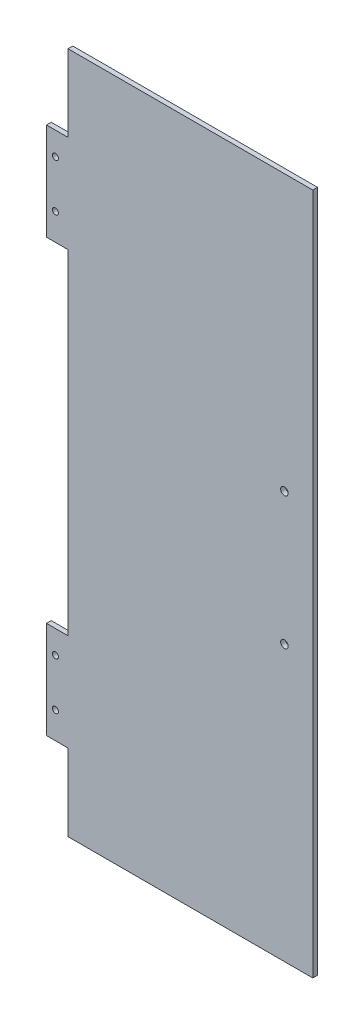
ISO-10303-21;
HEADER;
FILE_DESCRIPTION(('STEP AP214'),'2;1');
FILE_NAME('part.step','',(''),(''),'','','');
FILE_SCHEMA(('AUTOMOTIVE_DESIGN { 1 0 10303 214 1 1 1 1 }'));
ENDSEC;
DATA;
#1=APPLICATION_CONTEXT('core data for automotive mechanical design processes');
#2=APPLICATION_PROTOCOL_DEFINITION('international standard','automotive_design',2000,#1);
#3=PRODUCT_CONTEXT('',#1,'mechanical');
#4=PRODUCT('Part','Part','',(#3));
#5=PRODUCT_RELATED_PRODUCT_CATEGORY('part','',(#4));
#6=PRODUCT_DEFINITION_FORMATION('','',#4);
#7=PRODUCT_DEFINITION_CONTEXT('part definition',#1,'design');
#8=PRODUCT_DEFINITION('design','',#6,#7);
#9=PRODUCT_DEFINITION_SHAPE('','',#8);
#10=(LENGTH_UNIT() NAMED_UNIT(*) SI_UNIT(.MILLI.,.METRE.));
#11=(NAMED_UNIT(*) PLANE_ANGLE_UNIT() SI_UNIT($,.RADIAN.));
#12=(NAMED_UNIT(*) SI_UNIT($,.STERADIAN.) SOLID_ANGLE_UNIT());
#13=UNCERTAINTY_MEASURE_WITH_UNIT(LENGTH_MEASURE(1.E-05),#10,'distance_accuracy_value','');
#14=(GEOMETRIC_REPRESENTATION_CONTEXT(3) GLOBAL_UNCERTAINTY_ASSIGNED_CONTEXT((#13)) GLOBAL_UNIT_ASSIGNED_CONTEXT((#10,
#11,#12)) REPRESENTATION_CONTEXT('',''));
#15=CARTESIAN_POINT('',(0.,0.,0.));
#16=DIRECTION('',(0.,0.,1.));
#17=DIRECTION('',(1.,0.,0.));
#18=AXIS2_PLACEMENT_3D('',#15,#16,#17);
#19=CARTESIAN_POINT('',(0.,0.,3.175));
#20=DIRECTION('',(0.,-1.,0.));
#21=DIRECTION('',(0.,0.,-1.));
#22=AXIS2_PLACEMENT_3D('',#19,#20,#21);
#23=PLANE('',#22);
#24=DIRECTION('',(-1.,0.,0.));
#25=VECTOR('',#24,1.);
#26=CARTESIAN_POINT('',(0.,0.,0.));
#27=LINE('',#26,#25);
#28=CARTESIAN_POINT('',(0.,0.,0.));
#29=VERTEX_POINT('',#28);
#30=CARTESIAN_POINT('',(-164.338,0.,0.));
#31=VERTEX_POINT('',#30);
#32=EDGE_CURVE('E188',#29,#31,#27,.T.);
#33=ORIENTED_EDGE('',*,*,#32,.F.);
#34=DIRECTION('',(0.,0.,-1.));
#35=VECTOR('',#34,1.);
#36=CARTESIAN_POINT('',(0.,0.,3.175));
#37=LINE('',#36,#35);
#38=CARTESIAN_POINT('',(0.,0.,3.175));
#39=VERTEX_POINT('',#38);
#40=EDGE_CURVE('E148',#39,#29,#37,.T.);
#41=ORIENTED_EDGE('',*,*,#40,.F.);
#42=DIRECTION('',(-1.,0.,0.));
#43=VECTOR('',#42,1.);
#44=CARTESIAN_POINT('',(0.,0.,3.175));
#45=LINE('',#44,#43);
#46=CARTESIAN_POINT('',(-164.338,0.,3.175));
#47=VERTEX_POINT('',#46);
#48=EDGE_CURVE('E208',#39,#47,#45,.T.);
#49=ORIENTED_EDGE('',*,*,#48,.T.);
#50=DIRECTION('',(0.,0.,-1.));
#51=VECTOR('',#50,1.);
#52=CARTESIAN_POINT('',(-164.338,0.,3.175));
#53=LINE('',#52,#51);
#54=EDGE_CURVE('E145',#47,#31,#53,.T.);
#55=ORIENTED_EDGE('',*,*,#54,.T.);
#56=EDGE_LOOP('',(#33,#41,#49,#55));
#57=FACE_BOUND('',#56,.T.);
#58=ADVANCED_FACE('F75',(#57),#23,.T.);
#59=CARTESIAN_POINT('',(0.,0.,3.175));
#60=DIRECTION('',(-1.,0.,0.));
#61=DIRECTION('',(0.,0.,1.));
#62=AXIS2_PLACEMENT_3D('',#59,#60,#61);
#63=PLANE('',#62);
#64=DIRECTION('',(0.,1.,0.));
#65=VECTOR('',#64,1.);
#66=CARTESIAN_POINT('',(0.,0.,0.));
#67=LINE('',#66,#65);
#68=CARTESIAN_POINT('',(0.,458.216,0.));
#69=VERTEX_POINT('',#68);
#70=EDGE_CURVE('E185',#29,#69,#67,.T.);
#71=ORIENTED_EDGE('',*,*,#70,.T.);
#72=DIRECTION('',(0.,0.,-1.));
#73=VECTOR('',#72,1.);
#74=CARTESIAN_POINT('',(0.,458.216,3.175));
#75=LINE('',#74,#73);
#76=CARTESIAN_POINT('',(0.,458.216,3.175));
#77=VERTEX_POINT('',#76);
#78=EDGE_CURVE('E151',#77,#69,#75,.T.);
#79=ORIENTED_EDGE('',*,*,#78,.F.);
#80=DIRECTION('',(0.,1.,0.));
#81=VECTOR('',#80,1.);
#82=CARTESIAN_POINT('',(0.,0.,3.175));
#83=LINE('',#82,#81);
#84=EDGE_CURVE('E205',#39,#77,#83,.T.);
#85=ORIENTED_EDGE('',*,*,#84,.F.);
#86=ORIENTED_EDGE('',*,*,#40,.T.);
#87=EDGE_LOOP('',(#71,#79,#85,#86));
#88=FACE_BOUND('',#87,.T.);
#89=ADVANCED_FACE('F293',(#88),#63,.F.);
#90=CARTESIAN_POINT('',(0.,458.216,3.175));
#91=DIRECTION('',(0.,-1.,0.));
#92=DIRECTION('',(0.,0.,-1.));
#93=AXIS2_PLACEMENT_3D('',#90,#91,#92);
#94=PLANE('',#93);
#95=DIRECTION('',(-1.,0.,0.));
#96=VECTOR('',#95,1.);
#97=CARTESIAN_POINT('',(0.,458.216,0.));
#98=LINE('',#97,#96);
#99=CARTESIAN_POINT('',(-164.338,458.216,0.));
#100=VERTEX_POINT('',#99);
#101=EDGE_CURVE('E181',#69,#100,#98,.T.);
#102=ORIENTED_EDGE('',*,*,#101,.T.);
#103=DIRECTION('',(0.,0.,-1.));
#104=VECTOR('',#103,1.);
#105=CARTESIAN_POINT('',(-164.338,458.216,3.175));
#106=LINE('',#105,#104);
#107=CARTESIAN_POINT('',(-164.338,458.216,3.175));
#108=VERTEX_POINT('',#107);
#109=EDGE_CURVE('E154',#108,#100,#106,.T.);
#110=ORIENTED_EDGE('',*,*,#109,.F.);
#111=DIRECTION('',(-1.,0.,0.));
#112=VECTOR('',#111,1.);
#113=CARTESIAN_POINT('',(0.,458.216,3.175));
#114=LINE('',#113,#112);
#115=EDGE_CURVE('E201',#77,#108,#114,.T.);
#116=ORIENTED_EDGE('',*,*,#115,.F.);
#117=ORIENTED_EDGE('',*,*,#78,.T.);
#118=EDGE_LOOP('',(#102,#110,#116,#117));
#119=FACE_BOUND('',#118,.T.);
#120=ADVANCED_FACE('F336',(#119),#94,.F.);
#121=CARTESIAN_POINT('',(-164.338,0.,3.175));
#122=DIRECTION('',(-1.,0.,0.));
#123=DIRECTION('',(0.,0.,1.));
#124=AXIS2_PLACEMENT_3D('',#121,#122,#123);
#125=PLANE('',#124);
#126=DIRECTION('',(0.,1.,0.));
#127=VECTOR('',#126,1.);
#128=CARTESIAN_POINT('',(-164.338,0.,0.));
#129=LINE('',#128,#127);
#130=CARTESIAN_POINT('',(-164.338,406.654,0.));
#131=VERTEX_POINT('',#130);
#132=EDGE_CURVE('E184',#131,#100,#129,.T.);
#133=ORIENTED_EDGE('',*,*,#132,.F.);
#134=DIRECTION('',(0.,0.,1.));
#135=VECTOR('',#134,1.);
#136=CARTESIAN_POINT('',(-164.338,406.654,3.175));
#137=LINE('',#136,#135);
#138=CARTESIAN_POINT('',(-164.338,406.654,3.175));
#139=VERTEX_POINT('',#138);
#140=EDGE_CURVE('E85',#131,#139,#137,.T.);
#141=ORIENTED_EDGE('',*,*,#140,.T.);
#142=DIRECTION('',(0.,1.,0.));
#143=VECTOR('',#142,1.);
#144=CARTESIAN_POINT('',(-164.338,0.,3.175));
#145=LINE('',#144,#143);
#146=EDGE_CURVE('E204',#139,#108,#145,.T.);
#147=ORIENTED_EDGE('',*,*,#146,.T.);
#148=ORIENTED_EDGE('',*,*,#109,.T.);
#149=EDGE_LOOP('',(#133,#141,#147,#148));
#150=FACE_BOUND('',#149,.T.);
#151=ADVANCED_FACE('F334',(#150),#125,.T.);
#152=DIRECTION('',(0.,0.,1.));
#153=VECTOR('',#152,1.);
#154=CARTESIAN_POINT('',(-164.338,341.376,3.175));
#155=LINE('',#154,#153);
#156=CARTESIAN_POINT('',(-164.338,341.376,0.));
#157=VERTEX_POINT('',#156);
#158=CARTESIAN_POINT('',(-164.338,341.376,3.175));
#159=VERTEX_POINT('',#158);
#160=EDGE_CURVE('E12',#157,#159,#155,.T.);
#161=ORIENTED_EDGE('',*,*,#160,.F.);
#162=CARTESIAN_POINT('',(-164.338,116.84,0.));
#163=VERTEX_POINT('',#162);
#164=EDGE_CURVE('E180',#163,#157,#129,.T.);
#165=ORIENTED_EDGE('',*,*,#164,.F.);
#166=DIRECTION('',(0.,0.,-1.));
#167=VECTOR('',#166,1.);
#168=CARTESIAN_POINT('',(-164.338,116.84,3.175));
#169=LINE('',#168,#167);
#170=CARTESIAN_POINT('',(-164.338,116.84,3.175));
#171=VERTEX_POINT('',#170);
#172=EDGE_CURVE('E157',#171,#163,#169,.T.);
#173=ORIENTED_EDGE('',*,*,#172,.F.);
#174=EDGE_CURVE('E200',#171,#159,#145,.T.);
#175=ORIENTED_EDGE('',*,*,#174,.T.);
#176=EDGE_LOOP('',(#161,#165,#173,#175));
#177=FACE_BOUND('',#176,.T.);
#178=ADVANCED_FACE('F328',(#177),#125,.T.);
#179=CARTESIAN_POINT('',(1.11996182308678E-13,116.84,3.175));
#180=DIRECTION('',(0.,-1.,0.));
#181=DIRECTION('',(1.,0.,0.));
#182=AXIS2_PLACEMENT_3D('',#179,#180,#181);
#183=PLANE('',#182);
#184=DIRECTION('',(-1.,0.,0.));
#185=VECTOR('',#184,1.);
#186=CARTESIAN_POINT('',(1.11996182308678E-13,116.84,0.));
#187=LINE('',#186,#185);
#188=CARTESIAN_POINT('',(-178.816,116.84,0.));
#189=VERTEX_POINT('',#188);
#190=EDGE_CURVE('E177',#163,#189,#187,.T.);
#191=ORIENTED_EDGE('',*,*,#190,.T.);
#192=DIRECTION('',(0.,0.,-1.));
#193=VECTOR('',#192,1.);
#194=CARTESIAN_POINT('',(-178.816,116.84,3.175));
#195=LINE('',#194,#193);
#196=CARTESIAN_POINT('',(-178.816,116.84,3.175));
#197=VERTEX_POINT('',#196);
#198=EDGE_CURVE('E160',#197,#189,#195,.T.);
#199=ORIENTED_EDGE('',*,*,#198,.F.);
#200=DIRECTION('',(-1.,0.,0.));
#201=VECTOR('',#200,1.);
#202=CARTESIAN_POINT('',(1.11996182308678E-13,116.84,3.175));
#203=LINE('',#202,#201);
#204=EDGE_CURVE('E197',#171,#197,#203,.T.);
#205=ORIENTED_EDGE('',*,*,#204,.F.);
#206=ORIENTED_EDGE('',*,*,#172,.T.);
#207=EDGE_LOOP('',(#191,#199,#205,#206));
#208=FACE_BOUND('',#207,.T.);
#209=ADVANCED_FACE('F381',(#208),#183,.F.);
#210=CARTESIAN_POINT('',(-178.816,0.,3.175));
#211=DIRECTION('',(1.,0.,0.));
#212=DIRECTION('',(0.,0.,-1.));
#213=AXIS2_PLACEMENT_3D('',#210,#211,#212);
#214=PLANE('',#213);
#215=DIRECTION('',(0.,-1.,0.));
#216=VECTOR('',#215,1.);
#217=CARTESIAN_POINT('',(-178.816,0.,0.));
#218=LINE('',#217,#216);
#219=CARTESIAN_POINT('',(-178.816,51.5619999999999,0.));
#220=VERTEX_POINT('',#219);
#221=EDGE_CURVE('E174',#189,#220,#218,.T.);
#222=ORIENTED_EDGE('',*,*,#221,.T.);
#223=DIRECTION('',(0.,0.,-1.));
#224=VECTOR('',#223,1.);
#225=CARTESIAN_POINT('',(-178.816,51.5619999999999,3.175));
#226=LINE('',#225,#224);
#227=CARTESIAN_POINT('',(-178.816,51.5619999999999,3.175));
#228=VERTEX_POINT('',#227);
#229=EDGE_CURVE('E163',#228,#220,#226,.T.);
#230=ORIENTED_EDGE('',*,*,#229,.F.);
#231=DIRECTION('',(0.,-1.,0.));
#232=VECTOR('',#231,1.);
#233=CARTESIAN_POINT('',(-178.816,0.,3.175));
#234=LINE('',#233,#232);
#235=EDGE_CURVE('E194',#197,#228,#234,.T.);
#236=ORIENTED_EDGE('',*,*,#235,.F.);
#237=ORIENTED_EDGE('',*,*,#198,.T.);
#238=EDGE_LOOP('',(#222,#230,#236,#237));
#239=FACE_BOUND('',#238,.T.);
#240=ADVANCED_FACE('F377',(#239),#214,.F.);
#241=CARTESIAN_POINT('',(0.,51.562,3.175));
#242=DIRECTION('',(0.,-1.,0.));
#243=DIRECTION('',(1.,0.,0.));
#244=AXIS2_PLACEMENT_3D('',#241,#242,#243);
#245=PLANE('',#244);
#246=DIRECTION('',(-1.,0.,0.));
#247=VECTOR('',#246,1.);
#248=CARTESIAN_POINT('',(0.,51.562,0.));
#249=LINE('',#248,#247);
#250=CARTESIAN_POINT('',(-164.338,51.5619999999999,0.));
#251=VERTEX_POINT('',#250);
#252=EDGE_CURVE('E170',#251,#220,#249,.T.);
#253=ORIENTED_EDGE('',*,*,#252,.F.);
#254=DIRECTION('',(0.,0.,-1.));
#255=VECTOR('',#254,1.);
#256=CARTESIAN_POINT('',(-164.338,51.5619999999999,3.175));
#257=LINE('',#256,#255);
#258=CARTESIAN_POINT('',(-164.338,51.5619999999999,3.175));
#259=VERTEX_POINT('',#258);
#260=EDGE_CURVE('E166',#259,#251,#257,.T.);
#261=ORIENTED_EDGE('',*,*,#260,.F.);
#262=DIRECTION('',(-1.,0.,0.));
#263=VECTOR('',#262,1.);
#264=CARTESIAN_POINT('',(0.,51.562,3.175));
#265=LINE('',#264,#263);
#266=EDGE_CURVE('E169',#259,#228,#265,.T.);
#267=ORIENTED_EDGE('',*,*,#266,.T.);
#268=ORIENTED_EDGE('',*,*,#229,.T.);
#269=EDGE_LOOP('',(#253,#261,#267,#268));
#270=FACE_BOUND('',#269,.T.);
#271=ADVANCED_FACE('F374',(#270),#245,.T.);
#272=EDGE_CURVE('E124',#31,#251,#129,.T.);
#273=ORIENTED_EDGE('',*,*,#272,.F.);
#274=ORIENTED_EDGE('',*,*,#54,.F.);
#275=EDGE_CURVE('E173',#47,#259,#145,.T.);
#276=ORIENTED_EDGE('',*,*,#275,.T.);
#277=ORIENTED_EDGE('',*,*,#260,.T.);
#278=EDGE_LOOP('',(#273,#274,#276,#277));
#279=FACE_BOUND('',#278,.T.);
#280=ADVANCED_FACE('F344',(#279),#125,.T.);
#281=CARTESIAN_POINT('',(0.,0.,0.));
#282=DIRECTION('',(0.,0.,1.));
#283=DIRECTION('',(1.,0.,0.));
#284=AXIS2_PLACEMENT_3D('',#281,#282,#283);
#285=PLANE('',#284);
#286=CARTESIAN_POINT('',(-19.05,184.635815808074,0.));
#287=DIRECTION('',(0.,0.,1.));
#288=DIRECTION('',(1.,0.,0.));
#289=AXIS2_PLACEMENT_3D('',#286,#287,#288);
#290=CIRCLE('',#289,2.54);
#291=CARTESIAN_POINT('',(-16.51,184.635815808074,0.));
#292=VERTEX_POINT('',#291);
#293=EDGE_CURVE('E230',#292,#292,#290,.T.);
#294=ORIENTED_EDGE('',*,*,#293,.T.);
#295=EDGE_LOOP('',(#294));
#296=FACE_BOUND('',#295,.T.);
#297=CARTESIAN_POINT('',(-19.05,273.535815808073,0.));
#298=DIRECTION('',(0.,0.,1.));
#299=DIRECTION('',(1.,0.,0.));
#300=AXIS2_PLACEMENT_3D('',#297,#298,#299);
#301=CIRCLE('',#300,2.54);
#302=CARTESIAN_POINT('',(-16.51,273.535815808073,0.));
#303=VERTEX_POINT('',#302);
#304=EDGE_CURVE('E240',#303,#303,#301,.T.);
#305=ORIENTED_EDGE('',*,*,#304,.T.);
#306=EDGE_LOOP('',(#305));
#307=FACE_BOUND('',#306,.T.);
#308=CARTESIAN_POINT('',(-172.814936245777,69.4937947159434,0.));
#309=DIRECTION('',(0.,0.,1.));
#310=DIRECTION('',(1.,0.,0.));
#311=AXIS2_PLACEMENT_3D('',#308,#309,#310);
#312=CIRCLE('',#311,2.03200000000001);
#313=CARTESIAN_POINT('',(-170.782936245777,69.4937947159434,0.));
#314=VERTEX_POINT('',#313);
#315=EDGE_CURVE('E137',#314,#314,#312,.T.);
#316=ORIENTED_EDGE('',*,*,#315,.T.);
#317=EDGE_LOOP('',(#316));
#318=FACE_BOUND('',#317,.T.);
#319=CARTESIAN_POINT('',(-172.814936245777,359.41,0.));
#320=DIRECTION('',(0.,0.,1.));
#321=DIRECTION('',(-1.,0.,0.));
#322=AXIS2_PLACEMENT_3D('',#319,#320,#321);
#323=CIRCLE('',#322,2.03200000000001);
#324=CARTESIAN_POINT('',(-174.846936245777,359.41,0.));
#325=VERTEX_POINT('',#324);
#326=EDGE_CURVE('E217',#325,#325,#323,.T.);
#327=ORIENTED_EDGE('',*,*,#326,.T.);
#328=EDGE_LOOP('',(#327));
#329=FACE_BOUND('',#328,.T.);
#330=CARTESIAN_POINT('',(-172.814936245777,391.16,0.));
#331=DIRECTION('',(0.,0.,1.));
#332=DIRECTION('',(-1.,0.,0.));
#333=AXIS2_PLACEMENT_3D('',#330,#331,#332);
#334=CIRCLE('',#333,2.03200000000001);
#335=CARTESIAN_POINT('',(-174.846936245777,391.16,0.));
#336=VERTEX_POINT('',#335);
#337=EDGE_CURVE('E216',#336,#336,#334,.T.);
#338=ORIENTED_EDGE('',*,*,#337,.T.);
#339=EDGE_LOOP('',(#338));
#340=FACE_BOUND('',#339,.T.);
#341=CARTESIAN_POINT('',(-172.814936245777,101.243794715943,0.));
#342=DIRECTION('',(0.,0.,1.));
#343=DIRECTION('',(1.,0.,0.));
#344=AXIS2_PLACEMENT_3D('',#341,#342,#343);
#345=CIRCLE('',#344,2.03200000000001);
#346=CARTESIAN_POINT('',(-170.782936245777,101.243794715943,0.));
#347=VERTEX_POINT('',#346);
#348=EDGE_CURVE('E223',#347,#347,#345,.T.);
#349=ORIENTED_EDGE('',*,*,#348,.T.);
#350=EDGE_LOOP('',(#349));
#351=FACE_BOUND('',#350,.T.);
#352=ORIENTED_EDGE('',*,*,#272,.T.);
#353=ORIENTED_EDGE('',*,*,#252,.T.);
#354=ORIENTED_EDGE('',*,*,#221,.F.);
#355=ORIENTED_EDGE('',*,*,#190,.F.);
#356=ORIENTED_EDGE('',*,*,#164,.T.);
#357=DIRECTION('',(-1.,0.,0.));
#358=VECTOR('',#357,1.);
#359=CARTESIAN_POINT('',(-164.338,341.376,0.));
#360=LINE('',#359,#358);
#361=CARTESIAN_POINT('',(-178.816,341.376,0.));
#362=VERTEX_POINT('',#361);
#363=EDGE_CURVE('E135',#157,#362,#360,.T.);
#364=ORIENTED_EDGE('',*,*,#363,.T.);
#365=DIRECTION('',(0.,1.,0.));
#366=VECTOR('',#365,1.);
#367=CARTESIAN_POINT('',(-178.816,341.376,0.));
#368=LINE('',#367,#366);
#369=CARTESIAN_POINT('',(-178.816,406.654,0.));
#370=VERTEX_POINT('',#369);
#371=EDGE_CURVE('E119',#362,#370,#368,.T.);
#372=ORIENTED_EDGE('',*,*,#371,.T.);
#373=DIRECTION('',(-1.,0.,0.));
#374=VECTOR('',#373,1.);
#375=CARTESIAN_POINT('',(-164.338,406.654,0.));
#376=LINE('',#375,#374);
#377=EDGE_CURVE('E126',#131,#370,#376,.T.);
#378=ORIENTED_EDGE('',*,*,#377,.F.);
#379=ORIENTED_EDGE('',*,*,#132,.T.);
#380=ORIENTED_EDGE('',*,*,#101,.F.);
#381=ORIENTED_EDGE('',*,*,#70,.F.);
#382=ORIENTED_EDGE('',*,*,#32,.T.);
#383=EDGE_LOOP('',(#352,#353,#354,#355,#356,#364,#372,#378,#379,#380,#381,#382));
#384=FACE_BOUND('',#383,.T.);
#385=ADVANCED_FACE('F133',(#296,#307,#318,#329,#340,#351,#384),#285,.F.);
#386=CARTESIAN_POINT('',(0.,0.,3.175));
#387=DIRECTION('',(0.,0.,1.));
#388=DIRECTION('',(1.,0.,0.));
#389=AXIS2_PLACEMENT_3D('',#386,#387,#388);
#390=PLANE('',#389);
#391=CARTESIAN_POINT('',(-19.05,184.635815808074,3.175));
#392=DIRECTION('',(0.,0.,1.));
#393=DIRECTION('',(1.,0.,0.));
#394=AXIS2_PLACEMENT_3D('',#391,#392,#393);
#395=CIRCLE('',#394,2.54);
#396=CARTESIAN_POINT('',(-16.51,184.635815808074,3.175));
#397=VERTEX_POINT('',#396);
#398=EDGE_CURVE('E243',#397,#397,#395,.T.);
#399=ORIENTED_EDGE('',*,*,#398,.F.);
#400=EDGE_LOOP('',(#399));
#401=FACE_BOUND('',#400,.T.);
#402=CARTESIAN_POINT('',(-19.05,273.535815808073,3.175));
#403=DIRECTION('',(0.,0.,1.));
#404=DIRECTION('',(1.,0.,0.));
#405=AXIS2_PLACEMENT_3D('',#402,#403,#404);
#406=CIRCLE('',#405,2.54);
#407=CARTESIAN_POINT('',(-16.51,273.535815808073,3.175));
#408=VERTEX_POINT('',#407);
#409=EDGE_CURVE('E237',#408,#408,#406,.T.);
#410=ORIENTED_EDGE('',*,*,#409,.F.);
#411=EDGE_LOOP('',(#410));
#412=FACE_BOUND('',#411,.T.);
#413=CARTESIAN_POINT('',(-172.814936245777,69.4937947159434,3.175));
#414=DIRECTION('',(0.,0.,1.));
#415=DIRECTION('',(1.,0.,0.));
#416=AXIS2_PLACEMENT_3D('',#413,#414,#415);
#417=CIRCLE('',#416,2.03200000000001);
#418=CARTESIAN_POINT('',(-170.782936245777,69.4937947159434,3.175));
#419=VERTEX_POINT('',#418);
#420=EDGE_CURVE('E226',#419,#419,#417,.T.);
#421=ORIENTED_EDGE('',*,*,#420,.F.);
#422=EDGE_LOOP('',(#421));
#423=FACE_BOUND('',#422,.T.);
#424=CARTESIAN_POINT('',(-172.814936245777,359.41,3.175));
#425=DIRECTION('',(0.,0.,1.));
#426=DIRECTION('',(-1.,0.,0.));
#427=AXIS2_PLACEMENT_3D('',#424,#425,#426);
#428=CIRCLE('',#427,2.03200000000001);
#429=CARTESIAN_POINT('',(-174.846936245777,359.41,3.175));
#430=VERTEX_POINT('',#429);
#431=EDGE_CURVE('E227',#430,#430,#428,.T.);
#432=ORIENTED_EDGE('',*,*,#431,.F.);
#433=EDGE_LOOP('',(#432));
#434=FACE_BOUND('',#433,.T.);
#435=CARTESIAN_POINT('',(-172.814936245777,391.16,3.175));
#436=DIRECTION('',(0.,0.,1.));
#437=DIRECTION('',(-1.,0.,0.));
#438=AXIS2_PLACEMENT_3D('',#435,#436,#437);
#439=CIRCLE('',#438,2.03200000000001);
#440=CARTESIAN_POINT('',(-174.846936245777,391.16,3.175));
#441=VERTEX_POINT('',#440);
#442=EDGE_CURVE('E213',#441,#441,#439,.T.);
#443=ORIENTED_EDGE('',*,*,#442,.F.);
#444=EDGE_LOOP('',(#443));
#445=FACE_BOUND('',#444,.T.);
#446=CARTESIAN_POINT('',(-172.814936245777,101.243794715943,3.175));
#447=DIRECTION('',(0.,0.,1.));
#448=DIRECTION('',(1.,0.,0.));
#449=AXIS2_PLACEMENT_3D('',#446,#447,#448);
#450=CIRCLE('',#449,2.03200000000001);
#451=CARTESIAN_POINT('',(-170.782936245777,101.243794715943,3.175));
#452=VERTEX_POINT('',#451);
#453=EDGE_CURVE('E220',#452,#452,#450,.T.);
#454=ORIENTED_EDGE('',*,*,#453,.F.);
#455=EDGE_LOOP('',(#454));
#456=FACE_BOUND('',#455,.T.);
#457=ORIENTED_EDGE('',*,*,#275,.F.);
#458=ORIENTED_EDGE('',*,*,#48,.F.);
#459=ORIENTED_EDGE('',*,*,#84,.T.);
#460=ORIENTED_EDGE('',*,*,#115,.T.);
#461=ORIENTED_EDGE('',*,*,#146,.F.);
#462=DIRECTION('',(-1.,0.,0.));
#463=VECTOR('',#462,1.);
#464=CARTESIAN_POINT('',(-164.338,406.654,3.175));
#465=LINE('',#464,#463);
#466=CARTESIAN_POINT('',(-178.816,406.654,3.175));
#467=VERTEX_POINT('',#466);
#468=EDGE_CURVE('E140',#139,#467,#465,.T.);
#469=ORIENTED_EDGE('',*,*,#468,.T.);
#470=DIRECTION('',(0.,1.,0.));
#471=VECTOR('',#470,1.);
#472=CARTESIAN_POINT('',(-178.816,341.376,3.175));
#473=LINE('',#472,#471);
#474=CARTESIAN_POINT('',(-178.816,341.376,3.175));
#475=VERTEX_POINT('',#474);
#476=EDGE_CURVE('E122',#475,#467,#473,.T.);
#477=ORIENTED_EDGE('',*,*,#476,.F.);
#478=DIRECTION('',(-1.,0.,0.));
#479=VECTOR('',#478,1.);
#480=CARTESIAN_POINT('',(-164.338,341.376,3.175));
#481=LINE('',#480,#479);
#482=EDGE_CURVE('E130',#159,#475,#481,.T.);
#483=ORIENTED_EDGE('',*,*,#482,.F.);
#484=ORIENTED_EDGE('',*,*,#174,.F.);
#485=ORIENTED_EDGE('',*,*,#204,.T.);
#486=ORIENTED_EDGE('',*,*,#235,.T.);
#487=ORIENTED_EDGE('',*,*,#266,.F.);
#488=EDGE_LOOP('',(#457,#458,#459,#460,#461,#469,#477,#483,#484,#485,#486,#487));
#489=FACE_BOUND('',#488,.T.);
#490=ADVANCED_FACE('F258',(#401,#412,#423,#434,#445,#456,#489),#390,.T.);
#491=CARTESIAN_POINT('',(-164.338,406.654,3.175));
#492=DIRECTION('',(0.,-1.,0.));
#493=DIRECTION('',(0.,0.,-1.));
#494=AXIS2_PLACEMENT_3D('',#491,#492,#493);
#495=PLANE('',#494);
#496=ORIENTED_EDGE('',*,*,#377,.T.);
#497=DIRECTION('',(0.,0.,-1.));
#498=VECTOR('',#497,1.);
#499=CARTESIAN_POINT('',(-178.816,406.654,3.175));
#500=LINE('',#499,#498);
#501=EDGE_CURVE('E115',#467,#370,#500,.T.);
#502=ORIENTED_EDGE('',*,*,#501,.F.);
#503=ORIENTED_EDGE('',*,*,#468,.F.);
#504=ORIENTED_EDGE('',*,*,#140,.F.);
#505=EDGE_LOOP('',(#496,#502,#503,#504));
#506=FACE_BOUND('',#505,.T.);
#507=ADVANCED_FACE('F127',(#506),#495,.F.);
#508=CARTESIAN_POINT('',(-178.816,341.376,3.175));
#509=DIRECTION('',(-1.,0.,0.));
#510=DIRECTION('',(0.,0.,1.));
#511=AXIS2_PLACEMENT_3D('',#508,#509,#510);
#512=PLANE('',#511);
#513=ORIENTED_EDGE('',*,*,#371,.F.);
#514=DIRECTION('',(0.,0.,-1.));
#515=VECTOR('',#514,1.);
#516=CARTESIAN_POINT('',(-178.816,341.376,3.175));
#517=LINE('',#516,#515);
#518=EDGE_CURVE('E79',#475,#362,#517,.T.);
#519=ORIENTED_EDGE('',*,*,#518,.F.);
#520=ORIENTED_EDGE('',*,*,#476,.T.);
#521=ORIENTED_EDGE('',*,*,#501,.T.);
#522=EDGE_LOOP('',(#513,#519,#520,#521));
#523=FACE_BOUND('',#522,.T.);
#524=ADVANCED_FACE('F117',(#523),#512,.T.);
#525=CARTESIAN_POINT('',(-164.338,341.376,3.175));
#526=DIRECTION('',(0.,-1.,0.));
#527=DIRECTION('',(0.,0.,-1.));
#528=AXIS2_PLACEMENT_3D('',#525,#526,#527);
#529=PLANE('',#528);
#530=ORIENTED_EDGE('',*,*,#363,.F.);
#531=ORIENTED_EDGE('',*,*,#160,.T.);
#532=ORIENTED_EDGE('',*,*,#482,.T.);
#533=ORIENTED_EDGE('',*,*,#518,.T.);
#534=EDGE_LOOP('',(#530,#531,#532,#533));
#535=FACE_BOUND('',#534,.T.);
#536=ADVANCED_FACE('F77',(#535),#529,.T.);
#537=CARTESIAN_POINT('',(-172.814936245777,101.243794715943,0.));
#538=DIRECTION('',(0.,0.,1.));
#539=DIRECTION('',(1.,0.,0.));
#540=AXIS2_PLACEMENT_3D('',#537,#538,#539);
#541=CYLINDRICAL_SURFACE('',#540,2.03200000000001);
#542=ORIENTED_EDGE('',*,*,#348,.F.);
#543=EDGE_LOOP('',(#542));
#544=FACE_BOUND('',#543,.T.);
#545=ORIENTED_EDGE('',*,*,#453,.T.);
#546=EDGE_LOOP('',(#545));
#547=FACE_BOUND('',#546,.T.);
#548=ADVANCED_FACE('F353',(#544,#547),#541,.F.);
#549=CARTESIAN_POINT('',(-172.814936245777,391.16,0.));
#550=DIRECTION('',(0.,0.,1.));
#551=DIRECTION('',(1.,0.,0.));
#552=AXIS2_PLACEMENT_3D('',#549,#550,#551);
#553=CYLINDRICAL_SURFACE('',#552,2.03200000000001);
#554=ORIENTED_EDGE('',*,*,#337,.F.);
#555=EDGE_LOOP('',(#554));
#556=FACE_BOUND('',#555,.T.);
#557=ORIENTED_EDGE('',*,*,#442,.T.);
#558=EDGE_LOOP('',(#557));
#559=FACE_BOUND('',#558,.T.);
#560=ADVANCED_FACE('F358',(#556,#559),#553,.F.);
#561=CARTESIAN_POINT('',(-172.814936245777,359.41,0.));
#562=DIRECTION('',(0.,0.,1.));
#563=DIRECTION('',(1.,0.,0.));
#564=AXIS2_PLACEMENT_3D('',#561,#562,#563);
#565=CYLINDRICAL_SURFACE('',#564,2.03200000000001);
#566=ORIENTED_EDGE('',*,*,#326,.F.);
#567=EDGE_LOOP('',(#566));
#568=FACE_BOUND('',#567,.T.);
#569=ORIENTED_EDGE('',*,*,#431,.T.);
#570=EDGE_LOOP('',(#569));
#571=FACE_BOUND('',#570,.T.);
#572=ADVANCED_FACE('F364',(#568,#571),#565,.F.);
#573=CARTESIAN_POINT('',(-172.814936245777,69.4937947159434,0.));
#574=DIRECTION('',(0.,0.,1.));
#575=DIRECTION('',(1.,0.,0.));
#576=AXIS2_PLACEMENT_3D('',#573,#574,#575);
#577=CYLINDRICAL_SURFACE('',#576,2.03200000000001);
#578=ORIENTED_EDGE('',*,*,#315,.F.);
#579=EDGE_LOOP('',(#578));
#580=FACE_BOUND('',#579,.T.);
#581=ORIENTED_EDGE('',*,*,#420,.T.);
#582=EDGE_LOOP('',(#581));
#583=FACE_BOUND('',#582,.T.);
#584=ADVANCED_FACE('F440',(#580,#583),#577,.F.);
#585=CARTESIAN_POINT('',(-19.05,273.535815808073,0.));
#586=DIRECTION('',(0.,0.,1.));
#587=DIRECTION('',(1.,0.,0.));
#588=AXIS2_PLACEMENT_3D('',#585,#586,#587);
#589=CYLINDRICAL_SURFACE('',#588,2.54);
#590=ORIENTED_EDGE('',*,*,#304,.F.);
#591=EDGE_LOOP('',(#590));
#592=FACE_BOUND('',#591,.T.);
#593=ORIENTED_EDGE('',*,*,#409,.T.);
#594=EDGE_LOOP('',(#593));
#595=FACE_BOUND('',#594,.T.);
#596=ADVANCED_FACE('F254',(#592,#595),#589,.F.);
#597=CARTESIAN_POINT('',(-19.05,184.635815808074,0.));
#598=DIRECTION('',(0.,0.,1.));
#599=DIRECTION('',(1.,0.,0.));
#600=AXIS2_PLACEMENT_3D('',#597,#598,#599);
#601=CYLINDRICAL_SURFACE('',#600,2.54);
#602=ORIENTED_EDGE('',*,*,#293,.F.);
#603=EDGE_LOOP('',(#602));
#604=FACE_BOUND('',#603,.T.);
#605=ORIENTED_EDGE('',*,*,#398,.T.);
#606=EDGE_LOOP('',(#605));
#607=FACE_BOUND('',#606,.T.);
#608=ADVANCED_FACE('F251',(#604,#607),#601,.F.);
#609=CLOSED_SHELL('',(#58,#89,#120,#151,#178,#209,#240,#271,#280,#385,#490,#507,#524,#536,#548,
#560,#572,#584,#596,#608));
#610=MANIFOLD_SOLID_BREP('B2',#609);
#611=ADVANCED_BREP_SHAPE_REPRESENTATION('',(#18,#610),#14);
#612=SHAPE_DEFINITION_REPRESENTATION(#9,#611);
ENDSEC;
END-ISO-10303-21;
